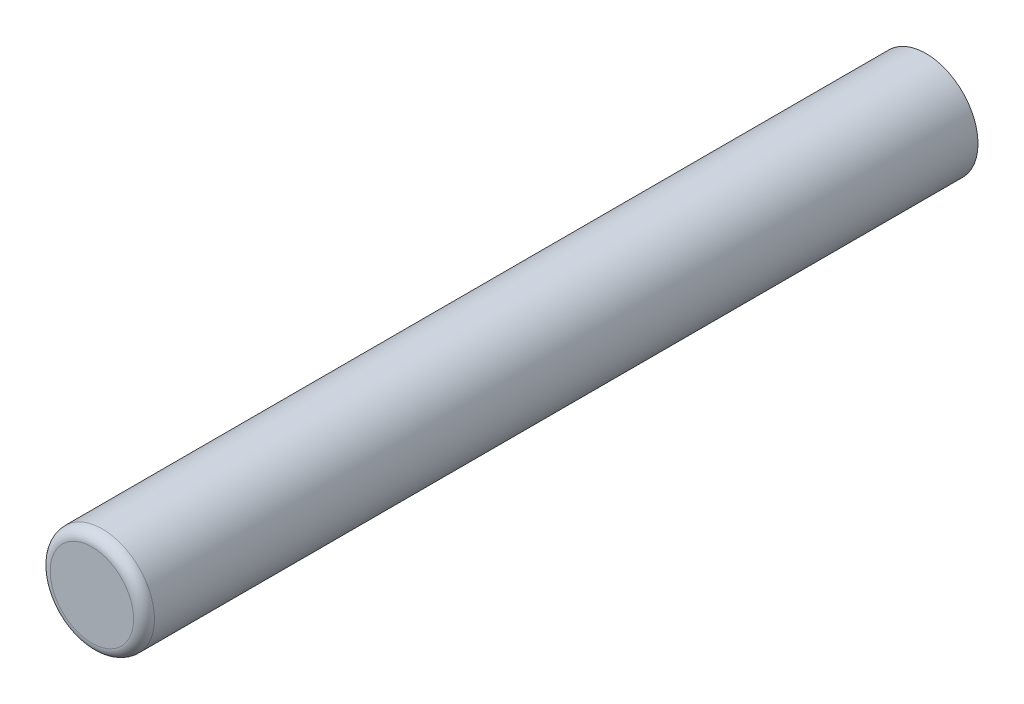
ISO-10303-21;
HEADER;
FILE_DESCRIPTION(('STEP AP214'),'2;1');
FILE_NAME('part.step','',(''),(''),'','','');
FILE_SCHEMA(('AUTOMOTIVE_DESIGN { 1 0 10303 214 1 1 1 1 }'));
ENDSEC;
DATA;
#1=APPLICATION_CONTEXT('core data for automotive mechanical design processes');
#2=APPLICATION_PROTOCOL_DEFINITION('international standard','automotive_design',2000,#1);
#3=PRODUCT_CONTEXT('',#1,'mechanical');
#4=PRODUCT('Part','Part','',(#3));
#5=PRODUCT_RELATED_PRODUCT_CATEGORY('part','',(#4));
#6=PRODUCT_DEFINITION_FORMATION('','',#4);
#7=PRODUCT_DEFINITION_CONTEXT('part definition',#1,'design');
#8=PRODUCT_DEFINITION('design','',#6,#7);
#9=PRODUCT_DEFINITION_SHAPE('','',#8);
#10=(LENGTH_UNIT() NAMED_UNIT(*) SI_UNIT(.MILLI.,.METRE.));
#11=(NAMED_UNIT(*) PLANE_ANGLE_UNIT() SI_UNIT($,.RADIAN.));
#12=(NAMED_UNIT(*) SI_UNIT($,.STERADIAN.) SOLID_ANGLE_UNIT());
#13=UNCERTAINTY_MEASURE_WITH_UNIT(LENGTH_MEASURE(1.E-05),#10,'distance_accuracy_value','');
#14=(GEOMETRIC_REPRESENTATION_CONTEXT(3) GLOBAL_UNCERTAINTY_ASSIGNED_CONTEXT((#13)) GLOBAL_UNIT_ASSIGNED_CONTEXT((#10,
#11,#12)) REPRESENTATION_CONTEXT('',''));
#15=CARTESIAN_POINT('',(0.,0.,0.));
#16=DIRECTION('',(0.,0.,1.));
#17=DIRECTION('',(1.,0.,0.));
#18=AXIS2_PLACEMENT_3D('',#15,#16,#17);
#19=CARTESIAN_POINT('',(0.,0.,0.));
#20=DIRECTION('',(0.,0.,1.));
#21=DIRECTION('',(1.,0.,0.));
#22=AXIS2_PLACEMENT_3D('',#19,#20,#21);
#23=PLANE('',#22);
#24=CARTESIAN_POINT('',(0.,0.,0.));
#25=DIRECTION('',(0.,0.,1.));
#26=DIRECTION('',(1.,0.,0.));
#27=AXIS2_PLACEMENT_3D('',#24,#25,#26);
#28=CIRCLE('',#27,6.35);
#29=CARTESIAN_POINT('',(6.35,0.,0.));
#30=VERTEX_POINT('',#29);
#31=EDGE_CURVE('E57',#30,#30,#28,.T.);
#32=ORIENTED_EDGE('',*,*,#31,.F.);
#33=EDGE_LOOP('',(#32));
#34=FACE_BOUND('',#33,.T.);
#35=CARTESIAN_POINT('',(0.,0.,0.));
#36=DIRECTION('',(0.,0.,-1.));
#37=DIRECTION('',(-1.,0.,0.));
#38=AXIS2_PLACEMENT_3D('',#35,#36,#37);
#39=CIRCLE('',#38,2.1);
#40=CARTESIAN_POINT('',(-2.1,0.,0.));
#41=VERTEX_POINT('',#40);
#42=EDGE_CURVE('E58',#41,#41,#39,.T.);
#43=ORIENTED_EDGE('',*,*,#42,.F.);
#44=EDGE_LOOP('',(#43));
#45=FACE_BOUND('',#44,.T.);
#46=ADVANCED_FACE('F37',(#34,#45),#23,.F.);
#47=CARTESIAN_POINT('',(0.,0.,101.6));
#48=DIRECTION('',(0.,0.,-1.));
#49=DIRECTION('',(-1.,0.,0.));
#50=AXIS2_PLACEMENT_3D('',#47,#48,#49);
#51=CYLINDRICAL_SURFACE('',#50,6.35);
#52=CARTESIAN_POINT('',(0.,0.,100.33));
#53=DIRECTION('',(0.,0.,1.));
#54=DIRECTION('',(1.,0.,0.));
#55=AXIS2_PLACEMENT_3D('',#52,#53,#54);
#56=CIRCLE('',#55,6.35);
#57=CARTESIAN_POINT('',(6.35,0.,100.33));
#58=VERTEX_POINT('',#57);
#59=EDGE_CURVE('E11',#58,#58,#56,.F.);
#60=ORIENTED_EDGE('',*,*,#59,.T.);
#61=EDGE_LOOP('',(#60));
#62=FACE_BOUND('',#61,.T.);
#63=ORIENTED_EDGE('',*,*,#31,.T.);
#64=EDGE_LOOP('',(#63));
#65=FACE_BOUND('',#64,.T.);
#66=ADVANCED_FACE('F76',(#62,#65),#51,.T.);
#67=CARTESIAN_POINT('',(0.,0.,101.6));
#68=DIRECTION('',(0.,0.,1.));
#69=DIRECTION('',(1.,0.,0.));
#70=AXIS2_PLACEMENT_3D('',#67,#68,#69);
#71=PLANE('',#70);
#72=CARTESIAN_POINT('',(0.,0.,101.6));
#73=DIRECTION('',(0.,0.,1.));
#74=DIRECTION('',(1.,0.,0.));
#75=AXIS2_PLACEMENT_3D('',#72,#73,#74);
#76=CIRCLE('',#75,5.08);
#77=CARTESIAN_POINT('',(5.08,0.,101.6));
#78=VERTEX_POINT('',#77);
#79=EDGE_CURVE('E44',#78,#78,#76,.T.);
#80=ORIENTED_EDGE('',*,*,#79,.T.);
#81=EDGE_LOOP('',(#80));
#82=FACE_BOUND('',#81,.T.);
#83=ADVANCED_FACE('F51',(#82),#71,.T.);
#84=CARTESIAN_POINT('',(0.,0.,25.4));
#85=DIRECTION('',(0.,0.,-1.));
#86=DIRECTION('',(-1.,0.,0.));
#87=AXIS2_PLACEMENT_3D('',#84,#85,#86);
#88=CONICAL_SURFACE('',#87,2.09999999999999,1.02974425867665);
#89=CARTESIAN_POINT('',(0.,0.,26.6618072999579));
#90=VERTEX_POINT('',#89);
#91=VERTEX_LOOP('',#90);
#92=FACE_BOUND('',#91,.T.);
#93=CARTESIAN_POINT('',(0.,0.,25.4));
#94=DIRECTION('',(0.,0.,-1.));
#95=DIRECTION('',(-1.,0.,0.));
#96=AXIS2_PLACEMENT_3D('',#93,#94,#95);
#97=CIRCLE('',#96,2.09999999999999);
#98=CARTESIAN_POINT('',(-2.09999999999999,0.,25.4));
#99=VERTEX_POINT('',#98);
#100=EDGE_CURVE('E55',#99,#99,#97,.T.);
#101=ORIENTED_EDGE('',*,*,#100,.T.);
#102=EDGE_LOOP('',(#101));
#103=FACE_BOUND('',#102,.T.);
#104=ADVANCED_FACE('F47',(#92,#103),#88,.F.);
#105=CARTESIAN_POINT('',(0.,0.,0.));
#106=DIRECTION('',(0.,0.,-1.));
#107=DIRECTION('',(-1.,0.,0.));
#108=AXIS2_PLACEMENT_3D('',#105,#106,#107);
#109=CYLINDRICAL_SURFACE('',#108,2.1);
#110=ORIENTED_EDGE('',*,*,#100,.F.);
#111=EDGE_LOOP('',(#110));
#112=FACE_BOUND('',#111,.T.);
#113=ORIENTED_EDGE('',*,*,#42,.T.);
#114=EDGE_LOOP('',(#113));
#115=FACE_BOUND('',#114,.T.);
#116=ADVANCED_FACE('F50',(#112,#115),#109,.F.);
#117=CARTESIAN_POINT('',(0.,0.,100.33));
#118=DIRECTION('',(0.,0.,1.));
#119=DIRECTION('',(1.,0.,0.));
#120=AXIS2_PLACEMENT_3D('',#117,#118,#119);
#121=TOROIDAL_SURFACE('',#120,5.08,1.27);
#122=ORIENTED_EDGE('',*,*,#59,.F.);
#123=EDGE_LOOP('',(#122));
#124=FACE_BOUND('',#123,.T.);
#125=ORIENTED_EDGE('',*,*,#79,.F.);
#126=EDGE_LOOP('',(#125));
#127=FACE_BOUND('',#126,.T.);
#128=ADVANCED_FACE('F39',(#124,#127),#121,.T.);
#129=CLOSED_SHELL('',(#46,#66,#83,#104,#116,#128));
#130=MANIFOLD_SOLID_BREP('B2',#129);
#131=ADVANCED_BREP_SHAPE_REPRESENTATION('',(#18,#130),#14);
#132=SHAPE_DEFINITION_REPRESENTATION(#9,#131);
ENDSEC;
END-ISO-10303-21;
